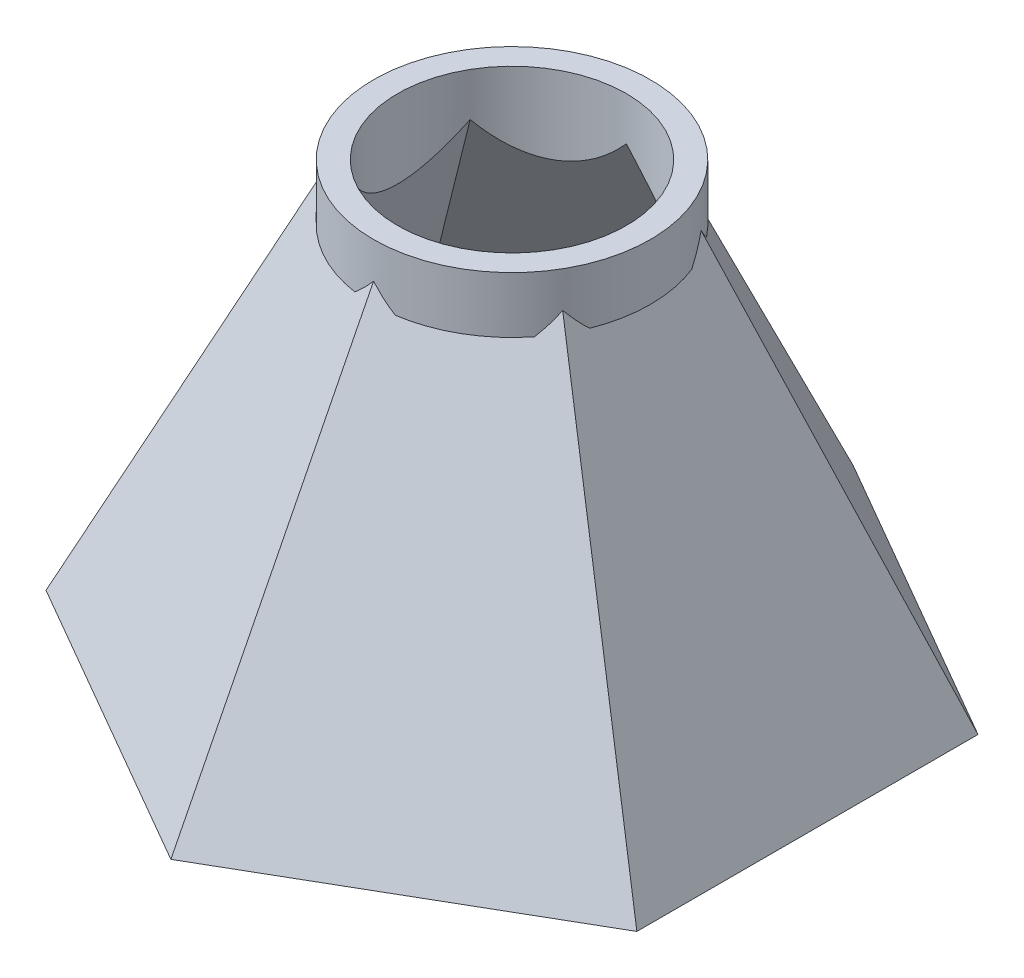
ISO-10303-21;
HEADER;
FILE_DESCRIPTION(('STEP AP214'),'2;1');
FILE_NAME('part.step','',(''),(''),'','','');
FILE_SCHEMA(('AUTOMOTIVE_DESIGN { 1 0 10303 214 1 1 1 1 }'));
ENDSEC;
DATA;
#1=APPLICATION_CONTEXT('core data for automotive mechanical design processes');
#2=APPLICATION_PROTOCOL_DEFINITION('international standard','automotive_design',2000,#1);
#3=PRODUCT_CONTEXT('',#1,'mechanical');
#4=PRODUCT('Part','Part','',(#3));
#5=PRODUCT_RELATED_PRODUCT_CATEGORY('part','',(#4));
#6=PRODUCT_DEFINITION_FORMATION('','',#4);
#7=PRODUCT_DEFINITION_CONTEXT('part definition',#1,'design');
#8=PRODUCT_DEFINITION('design','',#6,#7);
#9=PRODUCT_DEFINITION_SHAPE('','',#8);
#10=(LENGTH_UNIT() NAMED_UNIT(*) SI_UNIT(.MILLI.,.METRE.));
#11=(NAMED_UNIT(*) PLANE_ANGLE_UNIT() SI_UNIT($,.RADIAN.));
#12=(NAMED_UNIT(*) SI_UNIT($,.STERADIAN.) SOLID_ANGLE_UNIT());
#13=UNCERTAINTY_MEASURE_WITH_UNIT(LENGTH_MEASURE(1.E-05),#10,'distance_accuracy_value','');
#14=(GEOMETRIC_REPRESENTATION_CONTEXT(3) GLOBAL_UNCERTAINTY_ASSIGNED_CONTEXT((#13)) GLOBAL_UNIT_ASSIGNED_CONTEXT((#10,
#11,#12)) REPRESENTATION_CONTEXT('',''));
#15=CARTESIAN_POINT('',(0.,0.,0.));
#16=DIRECTION('',(0.,0.,1.));
#17=DIRECTION('',(1.,0.,0.));
#18=AXIS2_PLACEMENT_3D('',#15,#16,#17);
#19=CARTESIAN_POINT('',(-13.1666408178174,55.118,-7.60176362048999));
#20=DIRECTION('',(-0.457729684734172,0.402410415934552,-0.792811070092072));
#21=DIRECTION('',(0.866025403784439,0.,-0.5));
#22=AXIS2_PLACEMENT_3D('',#19,#20,#21);
#23=PLANE('',#22);
#24=CARTESIAN_POINT('',(0.,85.0713119019853,0.));
#25=DIRECTION('',(-0.457729684734172,0.402410415934552,-0.792811070092072));
#26=DIRECTION('',(0.201205207967276,0.915459369468346,0.348497642946785));
#27=AXIS2_PLACEMENT_3D('',#24,#25,#26);
#28=ELLIPSE('',#27,43.5525505951377,17.526);
#29=CARTESIAN_POINT('',(0.,50.5423676594151,-17.526));
#30=VERTEX_POINT('',#29);
#31=CARTESIAN_POINT('',(-2.55384480948767,48.006,-17.3389317055306));
#32=VERTEX_POINT('',#31);
#33=EDGE_CURVE('E376',#30,#32,#28,.T.);
#34=ORIENTED_EDGE('',*,*,#33,.F.);
#35=DIRECTION('',(0.,-0.891709289939976,-0.452608597172815));
#36=VECTOR('',#35,1.);
#37=CARTESIAN_POINT('',(0.,27.559,-29.1917636204902));
#38=LINE('',#37,#36);
#39=CARTESIAN_POINT('',(0.,0.,-43.1800000000004));
#40=VERTEX_POINT('',#39);
#41=EDGE_CURVE('E386',#30,#40,#38,.T.);
#42=ORIENTED_EDGE('',*,*,#41,.T.);
#43=DIRECTION('',(0.866025403784438,0.,-0.500000000000001));
#44=VECTOR('',#43,1.);
#45=CARTESIAN_POINT('',(-18.6974884677062,0.,-32.3850000000003));
#46=LINE('',#45,#44);
#47=CARTESIAN_POINT('',(-37.3949769354125,0.,-21.5900000000001));
#48=VERTEX_POINT('',#47);
#49=EDGE_CURVE('E399',#48,#40,#46,.T.);
#50=ORIENTED_EDGE('',*,*,#49,.F.);
#51=DIRECTION('',(-0.391970543122896,-0.891709289939976,-0.226304298586406));
#52=VECTOR('',#51,1.);
#53=CARTESIAN_POINT('',(-25.2808088766149,27.559,-14.5958818102451));
#54=LINE('',#53,#52);
#55=CARTESIAN_POINT('',(-15.1779612267261,50.5423676594151,-8.763));
#56=VERTEX_POINT('',#55);
#57=EDGE_CURVE('E397',#56,#48,#54,.T.);
#58=ORIENTED_EDGE('',*,*,#57,.F.);
#59=CARTESIAN_POINT('',(-13.7390329267291,48.006,-10.8811603351046));
#60=VERTEX_POINT('',#59);
#61=EDGE_CURVE('E373',#60,#56,#28,.T.);
#62=ORIENTED_EDGE('',*,*,#61,.F.);
#63=DIRECTION('',(0.866025403784439,0.,-0.5));
#64=VECTOR('',#63,1.);
#65=CARTESIAN_POINT('',(-14.7297592770171,48.006,-10.3091642100726));
#66=LINE('',#65,#64);
#67=EDGE_CURVE('E368',#60,#32,#66,.T.);
#68=ORIENTED_EDGE('',*,*,#67,.T.);
#69=EDGE_LOOP('',(#34,#42,#50,#58,#62,#68));
#70=FACE_BOUND('',#69,.T.);
#71=ADVANCED_FACE('F190',(#70),#23,.T.);
#72=CARTESIAN_POINT('',(0.,55.118,-15.20352724098));
#73=DIRECTION('',(0.457729684734172,0.402410415934553,-0.792811070092071));
#74=DIRECTION('',(0.866025403784439,0.,0.5));
#75=AXIS2_PLACEMENT_3D('',#72,#73,#74);
#76=PLANE('',#75);
#77=CARTESIAN_POINT('',(0.,85.0713119019852,0.));
#78=DIRECTION('',(0.457729684734172,0.402410415934553,-0.792811070092071));
#79=DIRECTION('',(-0.201205207967276,0.915459369468345,0.348497642946785));
#80=AXIS2_PLACEMENT_3D('',#77,#78,#79);
#81=ELLIPSE('',#80,43.5525505951376,17.526);
#82=CARTESIAN_POINT('',(15.177961226726,50.5423676594151,-8.76300000000005));
#83=VERTEX_POINT('',#82);
#84=CARTESIAN_POINT('',(13.7390329267291,48.006,-10.8811603351046));
#85=VERTEX_POINT('',#84);
#86=EDGE_CURVE('E383',#83,#85,#81,.T.);
#87=ORIENTED_EDGE('',*,*,#86,.F.);
#88=DIRECTION('',(0.391970543122892,-0.891709289939976,-0.226304298586414));
#89=VECTOR('',#88,1.);
#90=CARTESIAN_POINT('',(25.2808088766148,27.559,-14.5958818102453));
#91=LINE('',#90,#89);
#92=CARTESIAN_POINT('',(37.3949769354122,0.,-21.5900000000006));
#93=VERTEX_POINT('',#92);
#94=EDGE_CURVE('E389',#83,#93,#91,.T.);
#95=ORIENTED_EDGE('',*,*,#94,.T.);
#96=DIRECTION('',(0.866025403784441,0.,0.499999999999995));
#97=VECTOR('',#96,1.);
#98=CARTESIAN_POINT('',(18.6974884677061,0.,-32.3850000000005));
#99=LINE('',#98,#97);
#100=EDGE_CURVE('E402',#40,#93,#99,.T.);
#101=ORIENTED_EDGE('',*,*,#100,.F.);
#102=ORIENTED_EDGE('',*,*,#41,.F.);
#103=CARTESIAN_POINT('',(2.55384480948768,48.006,-17.3389317055306));
#104=VERTEX_POINT('',#103);
#105=EDGE_CURVE('E385',#104,#30,#81,.T.);
#106=ORIENTED_EDGE('',*,*,#105,.F.);
#107=DIRECTION('',(0.866025403784439,0.,0.5));
#108=VECTOR('',#107,1.);
#109=CARTESIAN_POINT('',(1.56311845919968,48.006,-17.9109278305626));
#110=LINE('',#109,#108);
#111=EDGE_CURVE('E365',#104,#85,#110,.T.);
#112=ORIENTED_EDGE('',*,*,#111,.T.);
#113=EDGE_LOOP('',(#87,#95,#101,#102,#106,#112));
#114=FACE_BOUND('',#113,.T.);
#115=ADVANCED_FACE('F463',(#114),#76,.T.);
#116=CARTESIAN_POINT('',(13.1666408178174,55.118,-7.60176362048999));
#117=DIRECTION('',(0.915459369468346,0.40241041593455,0.));
#118=DIRECTION('',(0.,0.,1.));
#119=AXIS2_PLACEMENT_3D('',#116,#117,#118);
#120=PLANE('',#119);
#121=CARTESIAN_POINT('',(0.,85.0713119019855,0.));
#122=DIRECTION('',(0.915459369468346,0.40241041593455,0.));
#123=DIRECTION('',(-0.40241041593455,0.915459369468346,0.));
#124=AXIS2_PLACEMENT_3D('',#121,#122,#123);
#125=ELLIPSE('',#124,43.552550595138,17.526);
#126=CARTESIAN_POINT('',(15.1779612267261,50.5423676594151,8.76299999999998));
#127=VERTEX_POINT('',#126);
#128=CARTESIAN_POINT('',(16.2928777362167,48.006,6.457771370426));
#129=VERTEX_POINT('',#128);
#130=EDGE_CURVE('E380',#127,#129,#125,.T.);
#131=ORIENTED_EDGE('',*,*,#130,.F.);
#132=DIRECTION('',(0.391970543122899,-0.891709289939976,0.226304298586402));
#133=VECTOR('',#132,1.);
#134=CARTESIAN_POINT('',(25.280808876615,27.559,14.5958818102449));
#135=LINE('',#134,#133);
#136=CARTESIAN_POINT('',(37.3949769354126,0.,21.5899999999999));
#137=VERTEX_POINT('',#136);
#138=EDGE_CURVE('E391',#127,#137,#135,.T.);
#139=ORIENTED_EDGE('',*,*,#138,.T.);
#140=DIRECTION('',(0.,0.,1.));
#141=VECTOR('',#140,1.);
#142=CARTESIAN_POINT('',(37.3949769354124,0.,-3.81639164714898E-13));
#143=LINE('',#142,#141);
#144=EDGE_CURVE('E405',#93,#137,#143,.T.);
#145=ORIENTED_EDGE('',*,*,#144,.F.);
#146=ORIENTED_EDGE('',*,*,#94,.F.);
#147=CARTESIAN_POINT('',(16.2928777362167,48.006,-6.45777137042602));
#148=VERTEX_POINT('',#147);
#149=EDGE_CURVE('E382',#148,#83,#125,.T.);
#150=ORIENTED_EDGE('',*,*,#149,.F.);
#151=DIRECTION('',(0.,0.,1.));
#152=VECTOR('',#151,1.);
#153=CARTESIAN_POINT('',(16.2928777362167,48.006,-7.60176362048999));
#154=LINE('',#153,#152);
#155=EDGE_CURVE('E362',#148,#129,#154,.T.);
#156=ORIENTED_EDGE('',*,*,#155,.T.);
#157=EDGE_LOOP('',(#131,#139,#145,#146,#150,#156));
#158=FACE_BOUND('',#157,.T.);
#159=ADVANCED_FACE('F469',(#158),#120,.T.);
#160=CARTESIAN_POINT('',(13.1666408178174,55.118,7.60176362048999));
#161=DIRECTION('',(0.457729684734173,0.40241041593455,0.792811070092073));
#162=DIRECTION('',(-0.866025403784439,0.,0.5));
#163=AXIS2_PLACEMENT_3D('',#160,#161,#162);
#164=PLANE('',#163);
#165=CARTESIAN_POINT('',(0.,85.0713119019855,0.));
#166=DIRECTION('',(0.457729684734173,0.40241041593455,0.792811070092073));
#167=DIRECTION('',(-0.201205207967275,0.915459369468346,-0.348497642946783));
#168=AXIS2_PLACEMENT_3D('',#165,#166,#167);
#169=ELLIPSE('',#168,43.5525505951379,17.526);
#170=CARTESIAN_POINT('',(0.,50.5423676594151,17.526));
#171=VERTEX_POINT('',#170);
#172=CARTESIAN_POINT('',(2.5538448094876,48.006,17.3389317055306));
#173=VERTEX_POINT('',#172);
#174=EDGE_CURVE('E377',#171,#173,#169,.T.);
#175=ORIENTED_EDGE('',*,*,#174,.F.);
#176=DIRECTION('',(0.,-0.891709289939976,0.452608597172815));
#177=VECTOR('',#176,1.);
#178=CARTESIAN_POINT('',(1.50053580671994E-13,27.559,29.1917636204902));
#179=LINE('',#178,#177);
#180=CARTESIAN_POINT('',(2.98372437868011E-13,0.,43.1800000000004));
#181=VERTEX_POINT('',#180);
#182=EDGE_CURVE('E393',#171,#181,#179,.T.);
#183=ORIENTED_EDGE('',*,*,#182,.T.);
#184=DIRECTION('',(-0.866025403784435,0.,0.500000000000007));
#185=VECTOR('',#184,1.);
#186=CARTESIAN_POINT('',(18.6974884677065,0.,32.3850000000001));
#187=LINE('',#186,#185);
#188=EDGE_CURVE('E408',#137,#181,#187,.T.);
#189=ORIENTED_EDGE('',*,*,#188,.F.);
#190=ORIENTED_EDGE('',*,*,#138,.F.);
#191=CARTESIAN_POINT('',(13.7390329267291,48.006,10.8811603351046));
#192=VERTEX_POINT('',#191);
#193=EDGE_CURVE('E379',#192,#127,#169,.T.);
#194=ORIENTED_EDGE('',*,*,#193,.F.);
#195=DIRECTION('',(-0.866025403784439,0.,0.5));
#196=VECTOR('',#195,1.);
#197=CARTESIAN_POINT('',(14.729759277017,48.006,10.3091642100726));
#198=LINE('',#197,#196);
#199=EDGE_CURVE('E359',#192,#173,#198,.T.);
#200=ORIENTED_EDGE('',*,*,#199,.T.);
#201=EDGE_LOOP('',(#175,#183,#189,#190,#194,#200));
#202=FACE_BOUND('',#201,.T.);
#203=ADVANCED_FACE('F478',(#202),#164,.T.);
#204=CARTESIAN_POINT('',(0.,55.118,15.20352724098));
#205=DIRECTION('',(-0.457729684734173,0.402410415934551,0.792811070092072));
#206=DIRECTION('',(-0.866025403784439,0.,-0.5));
#207=AXIS2_PLACEMENT_3D('',#204,#205,#206);
#208=PLANE('',#207);
#209=CARTESIAN_POINT('',(0.,85.0713119019854,0.));
#210=DIRECTION('',(-0.457729684734173,0.402410415934551,0.792811070092072));
#211=DIRECTION('',(0.201205207967275,0.915459369468346,-0.348497642946784));
#212=AXIS2_PLACEMENT_3D('',#209,#210,#211);
#213=ELLIPSE('',#212,43.5525505951378,17.526);
#214=CARTESIAN_POINT('',(-15.1779612267261,50.5423676594151,8.76300000000001));
#215=VERTEX_POINT('',#214);
#216=CARTESIAN_POINT('',(-13.7390329267291,48.006,10.8811603351046));
#217=VERTEX_POINT('',#216);
#218=EDGE_CURVE('E371',#215,#217,#213,.T.);
#219=ORIENTED_EDGE('',*,*,#218,.F.);
#220=DIRECTION('',(-0.391970543122894,-0.891709289939976,0.22630429858641));
#221=VECTOR('',#220,1.);
#222=CARTESIAN_POINT('',(-25.2808088766149,27.559,14.5958818102452));
#223=LINE('',#222,#221);
#224=CARTESIAN_POINT('',(-37.3949769354123,0.,21.5900000000004));
#225=VERTEX_POINT('',#224);
#226=EDGE_CURVE('E395',#215,#225,#223,.T.);
#227=ORIENTED_EDGE('',*,*,#226,.T.);
#228=DIRECTION('',(-0.866025403784441,0.,-0.499999999999995));
#229=VECTOR('',#228,1.);
#230=CARTESIAN_POINT('',(-18.697488467706,0.,32.3850000000004));
#231=LINE('',#230,#229);
#232=EDGE_CURVE('E411',#181,#225,#231,.T.);
#233=ORIENTED_EDGE('',*,*,#232,.F.);
#234=ORIENTED_EDGE('',*,*,#182,.F.);
#235=CARTESIAN_POINT('',(-2.55384480948761,48.006,17.3389317055306));
#236=VERTEX_POINT('',#235);
#237=EDGE_CURVE('E374',#236,#171,#213,.T.);
#238=ORIENTED_EDGE('',*,*,#237,.F.);
#239=DIRECTION('',(-0.866025403784439,0.,-0.5));
#240=VECTOR('',#239,1.);
#241=CARTESIAN_POINT('',(-1.56311845919967,48.006,17.9109278305626));
#242=LINE('',#241,#240);
#243=EDGE_CURVE('E352',#236,#217,#242,.T.);
#244=ORIENTED_EDGE('',*,*,#243,.T.);
#245=EDGE_LOOP('',(#219,#227,#233,#234,#238,#244));
#246=FACE_BOUND('',#245,.T.);
#247=ADVANCED_FACE('F481',(#246),#208,.T.);
#248=CARTESIAN_POINT('',(-13.1666408178174,55.118,7.60176362048998));
#249=DIRECTION('',(-0.915459369468346,0.402410415934552,0.));
#250=DIRECTION('',(0.,0.,-1.));
#251=AXIS2_PLACEMENT_3D('',#248,#249,#250);
#252=PLANE('',#251);
#253=CARTESIAN_POINT('',(0.,85.0713119019853,0.));
#254=DIRECTION('',(-0.915459369468346,0.402410415934552,0.));
#255=DIRECTION('',(0.402410415934552,0.915459369468346,0.));
#256=AXIS2_PLACEMENT_3D('',#253,#254,#255);
#257=ELLIPSE('',#256,43.5525505951377,17.526);
#258=CARTESIAN_POINT('',(-16.2928777362167,48.006,-6.45777137042595));
#259=VERTEX_POINT('',#258);
#260=EDGE_CURVE('E421',#56,#259,#257,.T.);
#261=ORIENTED_EDGE('',*,*,#260,.F.);
#262=ORIENTED_EDGE('',*,*,#57,.T.);
#263=DIRECTION('',(0.,0.,-1.));
#264=VECTOR('',#263,1.);
#265=CARTESIAN_POINT('',(-37.3949769354124,0.,1.21430643318376E-13));
#266=LINE('',#265,#264);
#267=EDGE_CURVE('E414',#225,#48,#266,.T.);
#268=ORIENTED_EDGE('',*,*,#267,.F.);
#269=ORIENTED_EDGE('',*,*,#226,.F.);
#270=CARTESIAN_POINT('',(-16.2928777362167,48.006,6.45777137042596));
#271=VERTEX_POINT('',#270);
#272=EDGE_CURVE('E419',#271,#215,#257,.T.);
#273=ORIENTED_EDGE('',*,*,#272,.F.);
#274=DIRECTION('',(0.,0.,-1.));
#275=VECTOR('',#274,1.);
#276=CARTESIAN_POINT('',(-16.2928777362167,48.006,7.60176362048999));
#277=LINE('',#276,#275);
#278=EDGE_CURVE('E388',#271,#259,#277,.T.);
#279=ORIENTED_EDGE('',*,*,#278,.T.);
#280=EDGE_LOOP('',(#261,#262,#268,#269,#273,#279));
#281=FACE_BOUND('',#280,.T.);
#282=ADVANCED_FACE('F192',(#281),#252,.T.);
#283=CARTESIAN_POINT('',(0.,0.,0.));
#284=DIRECTION('',(0.,-1.,0.));
#285=DIRECTION('',(0.,0.,-1.));
#286=AXIS2_PLACEMENT_3D('',#283,#284,#285);
#287=PLANE('',#286);
#288=DIRECTION('',(0.,0.,-1.));
#289=VECTOR('',#288,1.);
#290=CARTESIAN_POINT('',(-34.3469769354121,0.,0.));
#291=LINE('',#290,#289);
#292=CARTESIAN_POINT('',(-34.3469769354121,0.,19.83023637951));
#293=VERTEX_POINT('',#292);
#294=CARTESIAN_POINT('',(-34.3469769354121,0.,-19.83023637951));
#295=VERTEX_POINT('',#294);
#296=EDGE_CURVE('E318',#293,#295,#291,.T.);
#297=ORIENTED_EDGE('',*,*,#296,.F.);
#298=DIRECTION('',(-0.866025403784439,0.,-0.5));
#299=VECTOR('',#298,1.);
#300=CARTESIAN_POINT('',(-17.173488467706,0.,29.745354569265));
#301=LINE('',#300,#299);
#302=CARTESIAN_POINT('',(0.,0.,39.6604727590201));
#303=VERTEX_POINT('',#302);
#304=EDGE_CURVE('E324',#303,#293,#301,.T.);
#305=ORIENTED_EDGE('',*,*,#304,.F.);
#306=DIRECTION('',(-0.866025403784439,0.,0.5));
#307=VECTOR('',#306,1.);
#308=CARTESIAN_POINT('',(17.173488467706,0.,29.745354569265));
#309=LINE('',#308,#307);
#310=CARTESIAN_POINT('',(34.3469769354121,0.,19.83023637951));
#311=VERTEX_POINT('',#310);
#312=EDGE_CURVE('E205',#311,#303,#309,.T.);
#313=ORIENTED_EDGE('',*,*,#312,.F.);
#314=DIRECTION('',(0.,0.,1.));
#315=VECTOR('',#314,1.);
#316=CARTESIAN_POINT('',(34.3469769354121,0.,0.));
#317=LINE('',#316,#315);
#318=CARTESIAN_POINT('',(34.346976935412,0.,-19.8302363795101));
#319=VERTEX_POINT('',#318);
#320=EDGE_CURVE('E340',#319,#311,#317,.T.);
#321=ORIENTED_EDGE('',*,*,#320,.F.);
#322=DIRECTION('',(0.866025403784439,0.,0.5));
#323=VECTOR('',#322,1.);
#324=CARTESIAN_POINT('',(17.173488467706,0.,-29.7453545692651));
#325=LINE('',#324,#323);
#326=CARTESIAN_POINT('',(0.,0.,-39.6604727590201));
#327=VERTEX_POINT('',#326);
#328=EDGE_CURVE('E334',#327,#319,#325,.T.);
#329=ORIENTED_EDGE('',*,*,#328,.F.);
#330=DIRECTION('',(0.866025403784439,0.,-0.5));
#331=VECTOR('',#330,1.);
#332=CARTESIAN_POINT('',(-17.173488467706,0.,-29.745354569265));
#333=LINE('',#332,#331);
#334=EDGE_CURVE('E332',#295,#327,#333,.T.);
#335=ORIENTED_EDGE('',*,*,#334,.F.);
#336=EDGE_LOOP('',(#297,#305,#313,#321,#329,#335));
#337=FACE_BOUND('',#336,.T.);
#338=ORIENTED_EDGE('',*,*,#49,.T.);
#339=ORIENTED_EDGE('',*,*,#100,.T.);
#340=ORIENTED_EDGE('',*,*,#144,.T.);
#341=ORIENTED_EDGE('',*,*,#188,.T.);
#342=ORIENTED_EDGE('',*,*,#232,.T.);
#343=ORIENTED_EDGE('',*,*,#267,.T.);
#344=EDGE_LOOP('',(#338,#339,#340,#341,#342,#343));
#345=FACE_BOUND('',#344,.T.);
#346=ADVANCED_FACE('F328',(#337,#345),#287,.T.);
#347=CARTESIAN_POINT('',(0.,48.006,0.));
#348=DIRECTION('',(0.,1.,0.));
#349=DIRECTION('',(0.,0.,1.));
#350=AXIS2_PLACEMENT_3D('',#347,#348,#349);
#351=PLANE('',#350);
#352=ORIENTED_EDGE('',*,*,#67,.F.);
#353=CARTESIAN_POINT('',(0.,48.006,0.));
#354=DIRECTION('',(0.,1.,0.));
#355=DIRECTION('',(0.,0.,1.));
#356=AXIS2_PLACEMENT_3D('',#353,#354,#355);
#357=CIRCLE('',#356,17.526);
#358=EDGE_CURVE('E673',#32,#60,#357,.T.);
#359=ORIENTED_EDGE('',*,*,#358,.F.);
#360=EDGE_LOOP('',(#352,#359));
#361=FACE_BOUND('',#360,.T.);
#362=ADVANCED_FACE('F528',(#361),#351,.F.);
#363=ORIENTED_EDGE('',*,*,#111,.F.);
#364=EDGE_CURVE('E676',#85,#104,#357,.T.);
#365=ORIENTED_EDGE('',*,*,#364,.F.);
#366=EDGE_LOOP('',(#363,#365));
#367=FACE_BOUND('',#366,.T.);
#368=ADVANCED_FACE('F521',(#367),#351,.F.);
#369=ORIENTED_EDGE('',*,*,#155,.F.);
#370=EDGE_CURVE('E353',#129,#148,#357,.T.);
#371=ORIENTED_EDGE('',*,*,#370,.F.);
#372=EDGE_LOOP('',(#369,#371));
#373=FACE_BOUND('',#372,.T.);
#374=ADVANCED_FACE('F513',(#373),#351,.F.);
#375=ORIENTED_EDGE('',*,*,#199,.F.);
#376=EDGE_CURVE('E349',#173,#192,#357,.T.);
#377=ORIENTED_EDGE('',*,*,#376,.F.);
#378=EDGE_LOOP('',(#375,#377));
#379=FACE_BOUND('',#378,.T.);
#380=ADVANCED_FACE('F510',(#379),#351,.F.);
#381=ORIENTED_EDGE('',*,*,#243,.F.);
#382=EDGE_CURVE('E354',#217,#236,#357,.T.);
#383=ORIENTED_EDGE('',*,*,#382,.F.);
#384=EDGE_LOOP('',(#381,#383));
#385=FACE_BOUND('',#384,.T.);
#386=ADVANCED_FACE('F512',(#385),#351,.F.);
#387=CARTESIAN_POINT('',(0.,48.006,0.));
#388=DIRECTION('',(0.,1.,0.));
#389=DIRECTION('',(0.,0.,1.));
#390=AXIS2_PLACEMENT_3D('',#387,#388,#389);
#391=CYLINDRICAL_SURFACE('',#390,17.526);
#392=ORIENTED_EDGE('',*,*,#105,.T.);
#393=ORIENTED_EDGE('',*,*,#33,.T.);
#394=ORIENTED_EDGE('',*,*,#358,.T.);
#395=ORIENTED_EDGE('',*,*,#61,.T.);
#396=ORIENTED_EDGE('',*,*,#260,.T.);
#397=EDGE_CURVE('E677',#259,#271,#357,.T.);
#398=ORIENTED_EDGE('',*,*,#397,.T.);
#399=ORIENTED_EDGE('',*,*,#272,.T.);
#400=ORIENTED_EDGE('',*,*,#218,.T.);
#401=ORIENTED_EDGE('',*,*,#382,.T.);
#402=ORIENTED_EDGE('',*,*,#237,.T.);
#403=ORIENTED_EDGE('',*,*,#174,.T.);
#404=ORIENTED_EDGE('',*,*,#376,.T.);
#405=ORIENTED_EDGE('',*,*,#193,.T.);
#406=ORIENTED_EDGE('',*,*,#130,.T.);
#407=ORIENTED_EDGE('',*,*,#370,.T.);
#408=ORIENTED_EDGE('',*,*,#149,.T.);
#409=ORIENTED_EDGE('',*,*,#86,.T.);
#410=ORIENTED_EDGE('',*,*,#364,.T.);
#411=EDGE_LOOP('',(#392,#393,#394,#395,#396,#398,#399,#400,#401,#402,#403,#404,#405,#406,#407,
#408,#409,#410));
#412=FACE_BOUND('',#411,.T.);
#413=CARTESIAN_POINT('',(0.,55.118,0.));
#414=DIRECTION('',(0.,1.,0.));
#415=DIRECTION('',(0.,0.,1.));
#416=AXIS2_PLACEMENT_3D('',#413,#414,#415);
#417=CIRCLE('',#416,17.526);
#418=CARTESIAN_POINT('',(0.,55.118,17.526));
#419=VERTEX_POINT('',#418);
#420=EDGE_CURVE('E347',#419,#419,#417,.T.);
#421=ORIENTED_EDGE('',*,*,#420,.F.);
#422=EDGE_LOOP('',(#421));
#423=FACE_BOUND('',#422,.T.);
#424=ADVANCED_FACE('F507',(#412,#423),#391,.T.);
#425=ORIENTED_EDGE('',*,*,#278,.F.);
#426=ORIENTED_EDGE('',*,*,#397,.F.);
#427=EDGE_LOOP('',(#425,#426));
#428=FACE_BOUND('',#427,.T.);
#429=ADVANCED_FACE('F520',(#428),#351,.F.);
#430=CARTESIAN_POINT('',(0.,55.118,0.));
#431=DIRECTION('',(0.,-1.,0.));
#432=DIRECTION('',(0.,0.,-1.));
#433=AXIS2_PLACEMENT_3D('',#430,#431,#432);
#434=PLANE('',#433);
#435=CARTESIAN_POINT('',(0.,55.118,0.));
#436=DIRECTION('',(0.,1.,0.));
#437=DIRECTION('',(0.,0.,1.));
#438=AXIS2_PLACEMENT_3D('',#435,#436,#437);
#439=CIRCLE('',#438,14.478);
#440=CARTESIAN_POINT('',(0.,55.118,14.478));
#441=VERTEX_POINT('',#440);
#442=EDGE_CURVE('E344',#441,#441,#439,.T.);
#443=ORIENTED_EDGE('',*,*,#442,.F.);
#444=EDGE_LOOP('',(#443));
#445=FACE_BOUND('',#444,.T.);
#446=ORIENTED_EDGE('',*,*,#420,.T.);
#447=EDGE_LOOP('',(#446));
#448=FACE_BOUND('',#447,.T.);
#449=ADVANCED_FACE('F526',(#445,#448),#434,.F.);
#450=CARTESIAN_POINT('',(0.,-0.001000000000001,0.));
#451=DIRECTION('',(0.,1.,0.));
#452=DIRECTION('',(0.,0.,1.));
#453=AXIS2_PLACEMENT_3D('',#450,#451,#452);
#454=CYLINDRICAL_SURFACE('',#453,14.478);
#455=CARTESIAN_POINT('',(0.,78.1372961617136,0.));
#456=DIRECTION('',(-0.457729684734169,0.40241041593455,0.792811070092075));
#457=DIRECTION('',(0.201205207967273,0.915459369468347,-0.348497642946784));
#458=AXIS2_PLACEMENT_3D('',#455,#456,#457);
#459=ELLIPSE('',#458,35.9781939698966,14.478);
#460=CARTESIAN_POINT('',(0.,49.6133857004597,14.478));
#461=VERTEX_POINT('',#460);
#462=CARTESIAN_POINT('',(-12.5383157959911,49.6133857004597,7.23900000000004));
#463=VERTEX_POINT('',#462);
#464=EDGE_CURVE('E422',#461,#463,#459,.F.);
#465=ORIENTED_EDGE('',*,*,#464,.T.);
#466=CARTESIAN_POINT('',(0.,78.1372961617136,0.));
#467=DIRECTION('',(-0.915459369468347,0.402410415934549,0.));
#468=DIRECTION('',(0.402410415934549,0.915459369468347,0.));
#469=AXIS2_PLACEMENT_3D('',#466,#467,#468);
#470=ELLIPSE('',#469,35.9781939698966,14.478);
#471=CARTESIAN_POINT('',(-12.5383157959911,49.6133857004597,-7.23899999999998));
#472=VERTEX_POINT('',#471);
#473=EDGE_CURVE('E12',#463,#472,#470,.F.);
#474=ORIENTED_EDGE('',*,*,#473,.T.);
#475=CARTESIAN_POINT('',(0.,78.1372961617136,0.));
#476=DIRECTION('',(-0.457729684734174,0.402410415934549,-0.792811070092072));
#477=DIRECTION('',(0.201205207967275,0.915459369468347,0.348497642946781));
#478=AXIS2_PLACEMENT_3D('',#475,#476,#477);
#479=ELLIPSE('',#478,35.9781939698967,14.478);
#480=CARTESIAN_POINT('',(0.,49.6133857004597,-14.478));
#481=VERTEX_POINT('',#480);
#482=EDGE_CURVE('E198',#472,#481,#479,.F.);
#483=ORIENTED_EDGE('',*,*,#482,.T.);
#484=CARTESIAN_POINT('',(0.,78.1372961617137,0.));
#485=DIRECTION('',(0.457729684734169,0.40241041593455,-0.792811070092075));
#486=DIRECTION('',(-0.201205207967273,0.915459369468347,0.348497642946783));
#487=AXIS2_PLACEMENT_3D('',#484,#485,#486);
#488=ELLIPSE('',#487,35.9781939698966,14.478);
#489=CARTESIAN_POINT('',(12.538315795991,49.6133857004597,-7.23900000000011));
#490=VERTEX_POINT('',#489);
#491=EDGE_CURVE('E430',#481,#490,#488,.F.);
#492=ORIENTED_EDGE('',*,*,#491,.T.);
#493=CARTESIAN_POINT('',(0.,78.1372961617135,0.));
#494=DIRECTION('',(0.915459369468346,0.402410415934551,0.));
#495=DIRECTION('',(-0.402410415934551,0.915459369468346,0.));
#496=AXIS2_PLACEMENT_3D('',#493,#494,#495);
#497=ELLIPSE('',#496,35.9781939698965,14.478);
#498=CARTESIAN_POINT('',(12.5383157959912,49.6133857004597,7.23899999999992));
#499=VERTEX_POINT('',#498);
#500=EDGE_CURVE('E427',#490,#499,#497,.F.);
#501=ORIENTED_EDGE('',*,*,#500,.T.);
#502=CARTESIAN_POINT('',(0.,78.1372961617135,0.));
#503=DIRECTION('',(0.45772968473418,0.402410415934551,0.792811070092068));
#504=DIRECTION('',(-0.201205207967278,0.915459369468346,-0.348497642946782));
#505=AXIS2_PLACEMENT_3D('',#502,#503,#504);
#506=ELLIPSE('',#505,35.9781939698965,14.478);
#507=EDGE_CURVE('E424',#499,#461,#506,.F.);
#508=ORIENTED_EDGE('',*,*,#507,.T.);
#509=EDGE_LOOP('',(#465,#474,#483,#492,#501,#508));
#510=FACE_BOUND('',#509,.T.);
#511=ORIENTED_EDGE('',*,*,#442,.T.);
#512=EDGE_LOOP('',(#511));
#513=FACE_BOUND('',#512,.T.);
#514=ADVANCED_FACE('F434',(#510,#513),#454,.F.);
#515=CARTESIAN_POINT('',(-10.1186408178173,55.118,5.84200000000003));
#516=DIRECTION('',(-0.915459369468347,0.402410415934549,0.));
#517=DIRECTION('',(0.,0.,-1.));
#518=AXIS2_PLACEMENT_3D('',#515,#516,#517);
#519=PLANE('',#518);
#520=DIRECTION('',(-0.391970543122891,-0.891709289939979,0.226304298586404));
#521=VECTOR('',#520,1.);
#522=CARTESIAN_POINT('',(-22.2328088766147,27.559,12.836118189755));
#523=LINE('',#522,#521);
#524=EDGE_CURVE('E213',#463,#293,#523,.T.);
#525=ORIENTED_EDGE('',*,*,#524,.T.);
#526=ORIENTED_EDGE('',*,*,#296,.T.);
#527=DIRECTION('',(-0.391970543122891,-0.891709289939979,-0.226304298586406));
#528=VECTOR('',#527,1.);
#529=CARTESIAN_POINT('',(-22.2328088766147,27.559,-12.836118189755));
#530=LINE('',#529,#528);
#531=EDGE_CURVE('E348',#472,#295,#530,.T.);
#532=ORIENTED_EDGE('',*,*,#531,.F.);
#533=ORIENTED_EDGE('',*,*,#473,.F.);
#534=EDGE_LOOP('',(#525,#526,#532,#533));
#535=FACE_BOUND('',#534,.T.);
#536=ADVANCED_FACE('F315',(#535),#519,.F.);
#537=CARTESIAN_POINT('',(-10.1186408178174,55.118,-5.84199999999996));
#538=DIRECTION('',(-0.457729684734174,0.402410415934549,-0.792811070092072));
#539=DIRECTION('',(0.866025403784438,0.,-0.500000000000001));
#540=AXIS2_PLACEMENT_3D('',#537,#538,#539);
#541=PLANE('',#540);
#542=ORIENTED_EDGE('',*,*,#531,.T.);
#543=ORIENTED_EDGE('',*,*,#334,.T.);
#544=DIRECTION('',(0.,-0.891709289939979,-0.45260859717281));
#545=VECTOR('',#544,1.);
#546=CARTESIAN_POINT('',(0.,27.559,-25.67223637951));
#547=LINE('',#546,#545);
#548=EDGE_CURVE('E439',#481,#327,#547,.T.);
#549=ORIENTED_EDGE('',*,*,#548,.F.);
#550=ORIENTED_EDGE('',*,*,#482,.F.);
#551=EDGE_LOOP('',(#542,#543,#549,#550));
#552=FACE_BOUND('',#551,.T.);
#553=ADVANCED_FACE('F438',(#552),#541,.F.);
#554=CARTESIAN_POINT('',(0.,55.118,-11.684));
#555=DIRECTION('',(0.457729684734169,0.40241041593455,-0.792811070092075));
#556=DIRECTION('',(0.866025403784441,0.,0.499999999999995));
#557=AXIS2_PLACEMENT_3D('',#554,#555,#556);
#558=PLANE('',#557);
#559=ORIENTED_EDGE('',*,*,#548,.T.);
#560=ORIENTED_EDGE('',*,*,#328,.T.);
#561=DIRECTION('',(0.391970543122892,-0.891709289939979,-0.226304298586404));
#562=VECTOR('',#561,1.);
#563=CARTESIAN_POINT('',(22.2328088766147,27.559,-12.8361181897551));
#564=LINE('',#563,#562);
#565=EDGE_CURVE('E441',#490,#319,#564,.T.);
#566=ORIENTED_EDGE('',*,*,#565,.F.);
#567=ORIENTED_EDGE('',*,*,#491,.F.);
#568=EDGE_LOOP('',(#559,#560,#566,#567));
#569=FACE_BOUND('',#568,.T.);
#570=ADVANCED_FACE('F453',(#569),#558,.F.);
#571=CARTESIAN_POINT('',(10.1186408178173,55.118,-5.84200000000011));
#572=DIRECTION('',(0.915459369468346,0.402410415934551,0.));
#573=DIRECTION('',(0.,0.,1.));
#574=AXIS2_PLACEMENT_3D('',#571,#572,#573);
#575=PLANE('',#574);
#576=ORIENTED_EDGE('',*,*,#565,.T.);
#577=ORIENTED_EDGE('',*,*,#320,.T.);
#578=DIRECTION('',(0.39197054312289,-0.891709289939979,0.226304298586407));
#579=VECTOR('',#578,1.);
#580=CARTESIAN_POINT('',(22.2328088766147,27.559,12.836118189755));
#581=LINE('',#580,#579);
#582=EDGE_CURVE('E445',#499,#311,#581,.T.);
#583=ORIENTED_EDGE('',*,*,#582,.F.);
#584=ORIENTED_EDGE('',*,*,#500,.F.);
#585=EDGE_LOOP('',(#576,#577,#583,#584));
#586=FACE_BOUND('',#585,.T.);
#587=ADVANCED_FACE('F450',(#586),#575,.F.);
#588=CARTESIAN_POINT('',(10.1186408178174,55.118,5.84199999999989));
#589=DIRECTION('',(0.45772968473418,0.402410415934551,0.792811070092068));
#590=DIRECTION('',(-0.866025403784434,0.,0.500000000000007));
#591=AXIS2_PLACEMENT_3D('',#588,#589,#590);
#592=PLANE('',#591);
#593=ORIENTED_EDGE('',*,*,#582,.T.);
#594=ORIENTED_EDGE('',*,*,#312,.T.);
#595=DIRECTION('',(0.,-0.891709289939979,0.45260859717281));
#596=VECTOR('',#595,1.);
#597=CARTESIAN_POINT('',(0.,27.559,25.67223637951));
#598=LINE('',#597,#596);
#599=EDGE_CURVE('E321',#461,#303,#598,.T.);
#600=ORIENTED_EDGE('',*,*,#599,.F.);
#601=ORIENTED_EDGE('',*,*,#507,.F.);
#602=EDGE_LOOP('',(#593,#594,#600,#601));
#603=FACE_BOUND('',#602,.T.);
#604=ADVANCED_FACE('F447',(#603),#592,.F.);
#605=CARTESIAN_POINT('',(0.,55.118,11.684));
#606=DIRECTION('',(-0.457729684734169,0.40241041593455,0.792811070092075));
#607=DIRECTION('',(-0.866025403784441,0.,-0.499999999999995));
#608=AXIS2_PLACEMENT_3D('',#605,#606,#607);
#609=PLANE('',#608);
#610=ORIENTED_EDGE('',*,*,#599,.T.);
#611=ORIENTED_EDGE('',*,*,#304,.T.);
#612=ORIENTED_EDGE('',*,*,#524,.F.);
#613=ORIENTED_EDGE('',*,*,#464,.F.);
#614=EDGE_LOOP('',(#610,#611,#612,#613));
#615=FACE_BOUND('',#614,.T.);
#616=ADVANCED_FACE('F325',(#615),#609,.F.);
#617=CLOSED_SHELL('',(#71,#115,#159,#203,#247,#282,#346,#362,#368,#374,#380,#386,#424,#429,#449,
#514,#536,#553,#570,#587,#604,#616));
#618=MANIFOLD_SOLID_BREP('B2',#617);
#619=ADVANCED_BREP_SHAPE_REPRESENTATION('',(#18,#618),#14);
#620=SHAPE_DEFINITION_REPRESENTATION(#9,#619);
ENDSEC;
END-ISO-10303-21;
